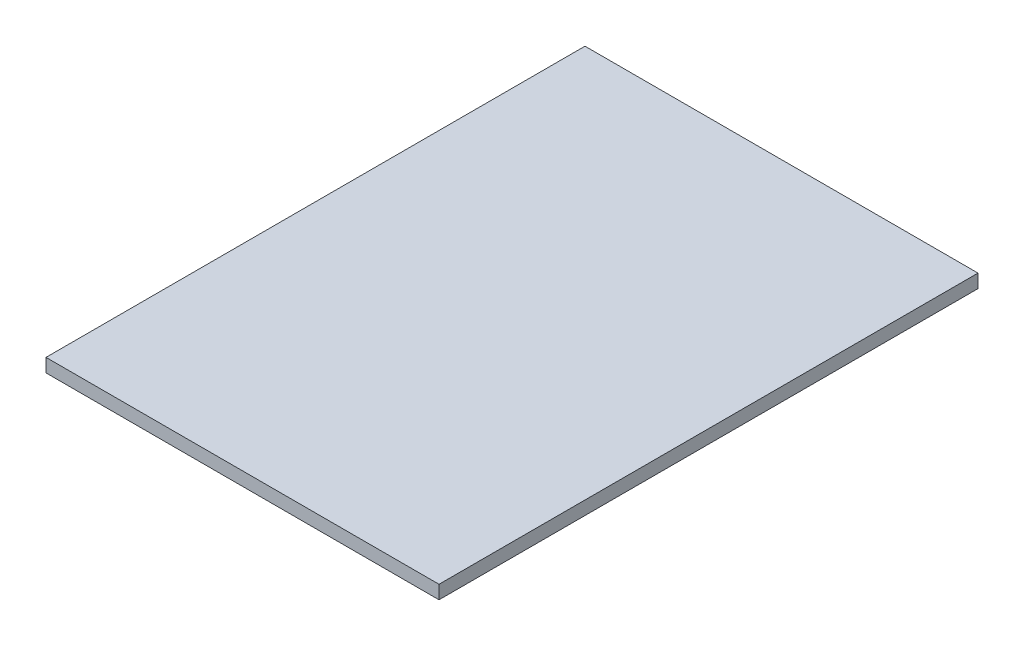
ISO-10303-21;
HEADER;
FILE_DESCRIPTION(('STEP AP214'),'2;1');
FILE_NAME('part.step','',(''),(''),'','','');
FILE_SCHEMA(('AUTOMOTIVE_DESIGN { 1 0 10303 214 1 1 1 1 }'));
ENDSEC;
DATA;
#1=APPLICATION_CONTEXT('core data for automotive mechanical design processes');
#2=APPLICATION_PROTOCOL_DEFINITION('international standard','automotive_design',2000,#1);
#3=PRODUCT_CONTEXT('',#1,'mechanical');
#4=PRODUCT('Part','Part','',(#3));
#5=PRODUCT_RELATED_PRODUCT_CATEGORY('part','',(#4));
#6=PRODUCT_DEFINITION_FORMATION('','',#4);
#7=PRODUCT_DEFINITION_CONTEXT('part definition',#1,'design');
#8=PRODUCT_DEFINITION('design','',#6,#7);
#9=PRODUCT_DEFINITION_SHAPE('','',#8);
#10=(LENGTH_UNIT() NAMED_UNIT(*) SI_UNIT(.MILLI.,.METRE.));
#11=(NAMED_UNIT(*) PLANE_ANGLE_UNIT() SI_UNIT($,.RADIAN.));
#12=(NAMED_UNIT(*) SI_UNIT($,.STERADIAN.) SOLID_ANGLE_UNIT());
#13=UNCERTAINTY_MEASURE_WITH_UNIT(LENGTH_MEASURE(1.E-05),#10,'distance_accuracy_value','');
#14=(GEOMETRIC_REPRESENTATION_CONTEXT(3) GLOBAL_UNCERTAINTY_ASSIGNED_CONTEXT((#13)) GLOBAL_UNIT_ASSIGNED_CONTEXT((#10,
#11,#12)) REPRESENTATION_CONTEXT('',''));
#15=CARTESIAN_POINT('',(0.,0.,0.));
#16=DIRECTION('',(0.,0.,1.));
#17=DIRECTION('',(1.,0.,0.));
#18=AXIS2_PLACEMENT_3D('',#15,#16,#17);
#19=CARTESIAN_POINT('',(-137.666666666667,12.,-238.));
#20=DIRECTION('',(1.,0.,0.));
#21=DIRECTION('',(0.,0.,-1.));
#22=AXIS2_PLACEMENT_3D('',#19,#20,#21);
#23=PLANE('',#22);
#24=DIRECTION('',(0.,0.,1.));
#25=VECTOR('',#24,1.);
#26=CARTESIAN_POINT('',(-137.666666666667,0.,-238.));
#27=LINE('',#26,#25);
#28=CARTESIAN_POINT('',(-137.666666666667,0.,-238.));
#29=VERTEX_POINT('',#28);
#30=CARTESIAN_POINT('',(-137.666666666666,0.,242.));
#31=VERTEX_POINT('',#30);
#32=EDGE_CURVE('E107',#29,#31,#27,.T.);
#33=ORIENTED_EDGE('',*,*,#32,.T.);
#34=DIRECTION('',(0.,-1.,0.));
#35=VECTOR('',#34,1.);
#36=CARTESIAN_POINT('',(-137.666666666666,12.,242.));
#37=LINE('',#36,#35);
#38=CARTESIAN_POINT('',(-137.666666666666,12.,242.));
#39=VERTEX_POINT('',#38);
#40=EDGE_CURVE('E11',#39,#31,#37,.T.);
#41=ORIENTED_EDGE('',*,*,#40,.F.);
#42=DIRECTION('',(0.,0.,1.));
#43=VECTOR('',#42,1.);
#44=CARTESIAN_POINT('',(-137.666666666667,12.,-238.));
#45=LINE('',#44,#43);
#46=CARTESIAN_POINT('',(-137.666666666667,12.,-238.));
#47=VERTEX_POINT('',#46);
#48=EDGE_CURVE('E91',#47,#39,#45,.T.);
#49=ORIENTED_EDGE('',*,*,#48,.F.);
#50=DIRECTION('',(0.,-1.,0.));
#51=VECTOR('',#50,1.);
#52=CARTESIAN_POINT('',(-137.666666666667,12.,-238.));
#53=LINE('',#52,#51);
#54=EDGE_CURVE('E103',#47,#29,#53,.T.);
#55=ORIENTED_EDGE('',*,*,#54,.T.);
#56=EDGE_LOOP('',(#33,#41,#49,#55));
#57=FACE_BOUND('',#56,.T.);
#58=ADVANCED_FACE('F39',(#57),#23,.F.);
#59=CARTESIAN_POINT('',(-137.666666666666,12.,242.));
#60=DIRECTION('',(0.,0.,-1.));
#61=DIRECTION('',(-1.,0.,0.));
#62=AXIS2_PLACEMENT_3D('',#59,#60,#61);
#63=PLANE('',#62);
#64=DIRECTION('',(1.,0.,0.));
#65=VECTOR('',#64,1.);
#66=CARTESIAN_POINT('',(-137.666666666666,0.,242.));
#67=LINE('',#66,#65);
#68=CARTESIAN_POINT('',(212.333333333334,0.,242.));
#69=VERTEX_POINT('',#68);
#70=EDGE_CURVE('E96',#31,#69,#67,.T.);
#71=ORIENTED_EDGE('',*,*,#70,.T.);
#72=DIRECTION('',(0.,-1.,0.));
#73=VECTOR('',#72,1.);
#74=CARTESIAN_POINT('',(212.333333333334,12.,242.));
#75=LINE('',#74,#73);
#76=CARTESIAN_POINT('',(212.333333333334,12.,242.));
#77=VERTEX_POINT('',#76);
#78=EDGE_CURVE('E48',#77,#69,#75,.T.);
#79=ORIENTED_EDGE('',*,*,#78,.F.);
#80=DIRECTION('',(1.,0.,0.));
#81=VECTOR('',#80,1.);
#82=CARTESIAN_POINT('',(-137.666666666666,12.,242.));
#83=LINE('',#82,#81);
#84=EDGE_CURVE('E86',#39,#77,#83,.T.);
#85=ORIENTED_EDGE('',*,*,#84,.F.);
#86=ORIENTED_EDGE('',*,*,#40,.T.);
#87=EDGE_LOOP('',(#71,#79,#85,#86));
#88=FACE_BOUND('',#87,.T.);
#89=ADVANCED_FACE('F95',(#88),#63,.F.);
#90=CARTESIAN_POINT('',(212.333333333333,12.,-238.));
#91=DIRECTION('',(-1.,0.,0.));
#92=DIRECTION('',(0.,0.,1.));
#93=AXIS2_PLACEMENT_3D('',#90,#91,#92);
#94=PLANE('',#93);
#95=DIRECTION('',(0.,0.,-1.));
#96=VECTOR('',#95,1.);
#97=CARTESIAN_POINT('',(212.333333333333,0.,-238.));
#98=LINE('',#97,#96);
#99=CARTESIAN_POINT('',(212.333333333333,0.,-238.));
#100=VERTEX_POINT('',#99);
#101=EDGE_CURVE('E73',#69,#100,#98,.T.);
#102=ORIENTED_EDGE('',*,*,#101,.T.);
#103=DIRECTION('',(0.,-1.,0.));
#104=VECTOR('',#103,1.);
#105=CARTESIAN_POINT('',(212.333333333333,12.,-238.));
#106=LINE('',#105,#104);
#107=CARTESIAN_POINT('',(212.333333333333,12.,-238.));
#108=VERTEX_POINT('',#107);
#109=EDGE_CURVE('E98',#108,#100,#106,.T.);
#110=ORIENTED_EDGE('',*,*,#109,.F.);
#111=DIRECTION('',(0.,0.,-1.));
#112=VECTOR('',#111,1.);
#113=CARTESIAN_POINT('',(212.333333333333,12.,-238.));
#114=LINE('',#113,#112);
#115=EDGE_CURVE('E89',#77,#108,#114,.T.);
#116=ORIENTED_EDGE('',*,*,#115,.F.);
#117=ORIENTED_EDGE('',*,*,#78,.T.);
#118=EDGE_LOOP('',(#102,#110,#116,#117));
#119=FACE_BOUND('',#118,.T.);
#120=ADVANCED_FACE('F99',(#119),#94,.F.);
#121=CARTESIAN_POINT('',(-137.666666666667,12.,-238.));
#122=DIRECTION('',(0.,0.,1.));
#123=DIRECTION('',(1.,0.,0.));
#124=AXIS2_PLACEMENT_3D('',#121,#122,#123);
#125=PLANE('',#124);
#126=DIRECTION('',(-1.,0.,0.));
#127=VECTOR('',#126,1.);
#128=CARTESIAN_POINT('',(-137.666666666667,0.,-238.));
#129=LINE('',#128,#127);
#130=EDGE_CURVE('E79',#100,#29,#129,.T.);
#131=ORIENTED_EDGE('',*,*,#130,.T.);
#132=ORIENTED_EDGE('',*,*,#54,.F.);
#133=DIRECTION('',(-1.,0.,0.));
#134=VECTOR('',#133,1.);
#135=CARTESIAN_POINT('',(-137.666666666667,12.,-238.));
#136=LINE('',#135,#134);
#137=EDGE_CURVE('E56',#108,#47,#136,.T.);
#138=ORIENTED_EDGE('',*,*,#137,.F.);
#139=ORIENTED_EDGE('',*,*,#109,.T.);
#140=EDGE_LOOP('',(#131,#132,#138,#139));
#141=FACE_BOUND('',#140,.T.);
#142=ADVANCED_FACE('F120',(#141),#125,.F.);
#143=CARTESIAN_POINT('',(0.,12.,0.));
#144=DIRECTION('',(0.,1.,0.));
#145=DIRECTION('',(0.,0.,1.));
#146=AXIS2_PLACEMENT_3D('',#143,#144,#145);
#147=PLANE('',#146);
#148=ORIENTED_EDGE('',*,*,#48,.T.);
#149=ORIENTED_EDGE('',*,*,#84,.T.);
#150=ORIENTED_EDGE('',*,*,#115,.T.);
#151=ORIENTED_EDGE('',*,*,#137,.T.);
#152=EDGE_LOOP('',(#148,#149,#150,#151));
#153=FACE_BOUND('',#152,.T.);
#154=ADVANCED_FACE('F87',(#153),#147,.T.);
#155=CARTESIAN_POINT('',(0.,0.,0.));
#156=DIRECTION('',(0.,1.,0.));
#157=DIRECTION('',(0.,0.,1.));
#158=AXIS2_PLACEMENT_3D('',#155,#156,#157);
#159=PLANE('',#158);
#160=ORIENTED_EDGE('',*,*,#32,.F.);
#161=ORIENTED_EDGE('',*,*,#130,.F.);
#162=ORIENTED_EDGE('',*,*,#101,.F.);
#163=ORIENTED_EDGE('',*,*,#70,.F.);
#164=EDGE_LOOP('',(#160,#161,#162,#163));
#165=FACE_BOUND('',#164,.T.);
#166=ADVANCED_FACE('F123',(#165),#159,.F.);
#167=CLOSED_SHELL('',(#58,#89,#120,#142,#154,#166));
#168=MANIFOLD_SOLID_BREP('B2',#167);
#169=ADVANCED_BREP_SHAPE_REPRESENTATION('',(#18,#168),#14);
#170=SHAPE_DEFINITION_REPRESENTATION(#9,#169);
ENDSEC;
END-ISO-10303-21;
